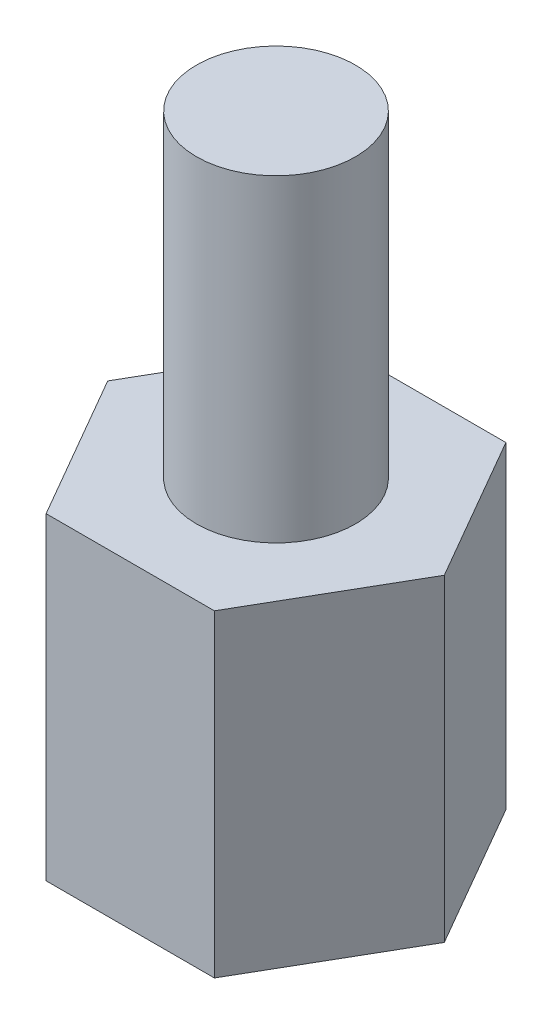
ISO-10303-21;
HEADER;
FILE_DESCRIPTION(('STEP AP214'),'2;1');
FILE_NAME('part.step','',(''),(''),'','','');
FILE_SCHEMA(('AUTOMOTIVE_DESIGN { 1 0 10303 214 1 1 1 1 }'));
ENDSEC;
DATA;
#1=APPLICATION_CONTEXT('core data for automotive mechanical design processes');
#2=APPLICATION_PROTOCOL_DEFINITION('international standard','automotive_design',2000,#1);
#3=PRODUCT_CONTEXT('',#1,'mechanical');
#4=PRODUCT('Part','Part','',(#3));
#5=PRODUCT_RELATED_PRODUCT_CATEGORY('part','',(#4));
#6=PRODUCT_DEFINITION_FORMATION('','',#4);
#7=PRODUCT_DEFINITION_CONTEXT('part definition',#1,'design');
#8=PRODUCT_DEFINITION('design','',#6,#7);
#9=PRODUCT_DEFINITION_SHAPE('','',#8);
#10=(LENGTH_UNIT() NAMED_UNIT(*) SI_UNIT(.MILLI.,.METRE.));
#11=(NAMED_UNIT(*) PLANE_ANGLE_UNIT() SI_UNIT($,.RADIAN.));
#12=(NAMED_UNIT(*) SI_UNIT($,.STERADIAN.) SOLID_ANGLE_UNIT());
#13=UNCERTAINTY_MEASURE_WITH_UNIT(LENGTH_MEASURE(1.E-05),#10,'distance_accuracy_value','');
#14=(GEOMETRIC_REPRESENTATION_CONTEXT(3) GLOBAL_UNCERTAINTY_ASSIGNED_CONTEXT((#13)) GLOBAL_UNIT_ASSIGNED_CONTEXT((#10,
#11,#12)) REPRESENTATION_CONTEXT('',''));
#15=CARTESIAN_POINT('',(0.,0.,0.));
#16=DIRECTION('',(0.,0.,1.));
#17=DIRECTION('',(1.,0.,0.));
#18=AXIS2_PLACEMENT_3D('',#15,#16,#17);
#19=CARTESIAN_POINT('',(1.58771324027147,6.,2.75000000000001));
#20=DIRECTION('',(-0.866025403784439,0.,-0.5));
#21=DIRECTION('',(-0.5,0.,0.866025403784439));
#22=AXIS2_PLACEMENT_3D('',#19,#20,#21);
#23=PLANE('',#22);
#24=DIRECTION('',(0.5,0.,-0.866025403784439));
#25=VECTOR('',#24,1.);
#26=CARTESIAN_POINT('',(1.58771324027147,0.,2.75000000000001));
#27=LINE('',#26,#25);
#28=CARTESIAN_POINT('',(1.58771324027147,0.,2.75000000000001));
#29=VERTEX_POINT('',#28);
#30=CARTESIAN_POINT('',(3.17542648054294,0.,0.));
#31=VERTEX_POINT('',#30);
#32=EDGE_CURVE('E136',#29,#31,#27,.T.);
#33=ORIENTED_EDGE('',*,*,#32,.T.);
#34=DIRECTION('',(0.,-1.,0.));
#35=VECTOR('',#34,1.);
#36=CARTESIAN_POINT('',(3.17542648054294,6.,0.));
#37=LINE('',#36,#35);
#38=CARTESIAN_POINT('',(3.17542648054294,6.,0.));
#39=VERTEX_POINT('',#38);
#40=EDGE_CURVE('E48',#39,#31,#37,.T.);
#41=ORIENTED_EDGE('',*,*,#40,.F.);
#42=DIRECTION('',(0.5,0.,-0.866025403784439));
#43=VECTOR('',#42,1.);
#44=CARTESIAN_POINT('',(1.58771324027147,6.,2.75000000000001));
#45=LINE('',#44,#43);
#46=CARTESIAN_POINT('',(1.58771324027147,6.,2.75000000000001));
#47=VERTEX_POINT('',#46);
#48=EDGE_CURVE('E153',#47,#39,#45,.T.);
#49=ORIENTED_EDGE('',*,*,#48,.F.);
#50=DIRECTION('',(0.,-1.,0.));
#51=VECTOR('',#50,1.);
#52=CARTESIAN_POINT('',(1.58771324027147,6.,2.75000000000001));
#53=LINE('',#52,#51);
#54=EDGE_CURVE('E132',#47,#29,#53,.T.);
#55=ORIENTED_EDGE('',*,*,#54,.T.);
#56=EDGE_LOOP('',(#33,#41,#49,#55));
#57=FACE_BOUND('',#56,.T.);
#58=ADVANCED_FACE('F45',(#57),#23,.F.);
#59=CARTESIAN_POINT('',(3.17542648054294,6.,0.));
#60=DIRECTION('',(-0.866025403784439,0.,0.5));
#61=DIRECTION('',(0.5,0.,0.866025403784439));
#62=AXIS2_PLACEMENT_3D('',#59,#60,#61);
#63=PLANE('',#62);
#64=DIRECTION('',(-0.5,0.,-0.866025403784439));
#65=VECTOR('',#64,1.);
#66=CARTESIAN_POINT('',(3.17542648054294,0.,0.));
#67=LINE('',#66,#65);
#68=CARTESIAN_POINT('',(1.58771324027147,0.,-2.75000000000001));
#69=VERTEX_POINT('',#68);
#70=EDGE_CURVE('E140',#31,#69,#67,.T.);
#71=ORIENTED_EDGE('',*,*,#70,.T.);
#72=DIRECTION('',(0.,-1.,0.));
#73=VECTOR('',#72,1.);
#74=CARTESIAN_POINT('',(1.58771324027147,6.,-2.75000000000001));
#75=LINE('',#74,#73);
#76=CARTESIAN_POINT('',(1.58771324027147,6.,-2.75000000000001));
#77=VERTEX_POINT('',#76);
#78=EDGE_CURVE('E159',#77,#69,#75,.T.);
#79=ORIENTED_EDGE('',*,*,#78,.F.);
#80=DIRECTION('',(-0.5,0.,-0.866025403784439));
#81=VECTOR('',#80,1.);
#82=CARTESIAN_POINT('',(3.17542648054294,6.,0.));
#83=LINE('',#82,#81);
#84=EDGE_CURVE('E101',#39,#77,#83,.T.);
#85=ORIENTED_EDGE('',*,*,#84,.F.);
#86=ORIENTED_EDGE('',*,*,#40,.T.);
#87=EDGE_LOOP('',(#71,#79,#85,#86));
#88=FACE_BOUND('',#87,.T.);
#89=ADVANCED_FACE('F166',(#88),#63,.F.);
#90=CARTESIAN_POINT('',(1.58771324027147,6.,-2.75000000000001));
#91=DIRECTION('',(0.,0.,1.));
#92=DIRECTION('',(1.,0.,0.));
#93=AXIS2_PLACEMENT_3D('',#90,#91,#92);
#94=PLANE('',#93);
#95=DIRECTION('',(-1.,0.,0.));
#96=VECTOR('',#95,1.);
#97=CARTESIAN_POINT('',(1.58771324027147,0.,-2.75000000000001));
#98=LINE('',#97,#96);
#99=CARTESIAN_POINT('',(-1.58771324027147,0.,-2.75000000000001));
#100=VERTEX_POINT('',#99);
#101=EDGE_CURVE('E144',#69,#100,#98,.T.);
#102=ORIENTED_EDGE('',*,*,#101,.T.);
#103=DIRECTION('',(0.,-1.,0.));
#104=VECTOR('',#103,1.);
#105=CARTESIAN_POINT('',(-1.58771324027147,6.,-2.75000000000001));
#106=LINE('',#105,#104);
#107=CARTESIAN_POINT('',(-1.58771324027147,6.,-2.75000000000001));
#108=VERTEX_POINT('',#107);
#109=EDGE_CURVE('E125',#108,#100,#106,.T.);
#110=ORIENTED_EDGE('',*,*,#109,.F.);
#111=DIRECTION('',(-1.,0.,0.));
#112=VECTOR('',#111,1.);
#113=CARTESIAN_POINT('',(1.58771324027147,6.,-2.75000000000001));
#114=LINE('',#113,#112);
#115=EDGE_CURVE('E114',#77,#108,#114,.T.);
#116=ORIENTED_EDGE('',*,*,#115,.F.);
#117=ORIENTED_EDGE('',*,*,#78,.T.);
#118=EDGE_LOOP('',(#102,#110,#116,#117));
#119=FACE_BOUND('',#118,.T.);
#120=ADVANCED_FACE('F172',(#119),#94,.F.);
#121=CARTESIAN_POINT('',(-1.58771324027147,6.,-2.75000000000001));
#122=DIRECTION('',(0.866025403784439,0.,0.499999999999999));
#123=DIRECTION('',(0.499999999999999,0.,-0.866025403784439));
#124=AXIS2_PLACEMENT_3D('',#121,#122,#123);
#125=PLANE('',#124);
#126=DIRECTION('',(-0.499999999999999,0.,0.866025403784439));
#127=VECTOR('',#126,1.);
#128=CARTESIAN_POINT('',(-1.58771324027147,0.,-2.75000000000001));
#129=LINE('',#128,#127);
#130=CARTESIAN_POINT('',(-3.17542648054295,0.,0.));
#131=VERTEX_POINT('',#130);
#132=EDGE_CURVE('E123',#100,#131,#129,.T.);
#133=ORIENTED_EDGE('',*,*,#132,.T.);
#134=DIRECTION('',(0.,-1.,0.));
#135=VECTOR('',#134,1.);
#136=CARTESIAN_POINT('',(-3.17542648054295,6.,0.));
#137=LINE('',#136,#135);
#138=CARTESIAN_POINT('',(-3.17542648054295,6.,0.));
#139=VERTEX_POINT('',#138);
#140=EDGE_CURVE('E120',#139,#131,#137,.T.);
#141=ORIENTED_EDGE('',*,*,#140,.F.);
#142=DIRECTION('',(-0.499999999999999,0.,0.866025403784439));
#143=VECTOR('',#142,1.);
#144=CARTESIAN_POINT('',(-1.58771324027147,6.,-2.75000000000001));
#145=LINE('',#144,#143);
#146=EDGE_CURVE('E108',#108,#139,#145,.T.);
#147=ORIENTED_EDGE('',*,*,#146,.F.);
#148=ORIENTED_EDGE('',*,*,#109,.T.);
#149=EDGE_LOOP('',(#133,#141,#147,#148));
#150=FACE_BOUND('',#149,.T.);
#151=ADVANCED_FACE('F121',(#150),#125,.F.);
#152=CARTESIAN_POINT('',(-3.17542648054295,6.,0.));
#153=DIRECTION('',(0.866025403784439,0.,-0.499999999999999));
#154=DIRECTION('',(-0.5,0.,-0.866025403784439));
#155=AXIS2_PLACEMENT_3D('',#152,#153,#154);
#156=PLANE('',#155);
#157=DIRECTION('',(0.5,0.,0.866025403784439));
#158=VECTOR('',#157,1.);
#159=CARTESIAN_POINT('',(-3.17542648054295,0.,0.));
#160=LINE('',#159,#158);
#161=CARTESIAN_POINT('',(-1.58771324027148,0.,2.75000000000001));
#162=VERTEX_POINT('',#161);
#163=EDGE_CURVE('E86',#131,#162,#160,.T.);
#164=ORIENTED_EDGE('',*,*,#163,.T.);
#165=DIRECTION('',(0.,-1.,0.));
#166=VECTOR('',#165,1.);
#167=CARTESIAN_POINT('',(-1.58771324027148,6.,2.75000000000001));
#168=LINE('',#167,#166);
#169=CARTESIAN_POINT('',(-1.58771324027148,6.,2.75000000000001));
#170=VERTEX_POINT('',#169);
#171=EDGE_CURVE('E126',#170,#162,#168,.T.);
#172=ORIENTED_EDGE('',*,*,#171,.F.);
#173=DIRECTION('',(0.5,0.,0.866025403784439));
#174=VECTOR('',#173,1.);
#175=CARTESIAN_POINT('',(-3.17542648054295,6.,0.));
#176=LINE('',#175,#174);
#177=EDGE_CURVE('E112',#139,#170,#176,.T.);
#178=ORIENTED_EDGE('',*,*,#177,.F.);
#179=ORIENTED_EDGE('',*,*,#140,.T.);
#180=EDGE_LOOP('',(#164,#172,#178,#179));
#181=FACE_BOUND('',#180,.T.);
#182=ADVANCED_FACE('F128',(#181),#156,.F.);
#183=CARTESIAN_POINT('',(-1.58771324027148,6.,2.75000000000001));
#184=DIRECTION('',(0.,0.,-1.));
#185=DIRECTION('',(-1.,0.,0.));
#186=AXIS2_PLACEMENT_3D('',#183,#184,#185);
#187=PLANE('',#186);
#188=DIRECTION('',(1.,0.,0.));
#189=VECTOR('',#188,1.);
#190=CARTESIAN_POINT('',(-1.58771324027148,0.,2.75000000000001));
#191=LINE('',#190,#189);
#192=EDGE_CURVE('E92',#162,#29,#191,.T.);
#193=ORIENTED_EDGE('',*,*,#192,.T.);
#194=ORIENTED_EDGE('',*,*,#54,.F.);
#195=DIRECTION('',(1.,0.,0.));
#196=VECTOR('',#195,1.);
#197=CARTESIAN_POINT('',(-1.58771324027148,6.,2.75000000000001));
#198=LINE('',#197,#196);
#199=EDGE_CURVE('E63',#170,#47,#198,.T.);
#200=ORIENTED_EDGE('',*,*,#199,.F.);
#201=ORIENTED_EDGE('',*,*,#171,.T.);
#202=EDGE_LOOP('',(#193,#194,#200,#201));
#203=FACE_BOUND('',#202,.T.);
#204=ADVANCED_FACE('F201',(#203),#187,.F.);
#205=CARTESIAN_POINT('',(0.,6.,0.));
#206=DIRECTION('',(0.,1.,0.));
#207=DIRECTION('',(0.,0.,1.));
#208=AXIS2_PLACEMENT_3D('',#205,#206,#207);
#209=PLANE('',#208);
#210=CARTESIAN_POINT('',(0.,6.,0.));
#211=DIRECTION('',(0.,1.,0.));
#212=DIRECTION('',(0.,0.,1.));
#213=AXIS2_PLACEMENT_3D('',#210,#211,#212);
#214=CIRCLE('',#213,1.5);
#215=CARTESIAN_POINT('',(0.,6.,1.5));
#216=VERTEX_POINT('',#215);
#217=EDGE_CURVE('E11',#216,#216,#214,.T.);
#218=ORIENTED_EDGE('',*,*,#217,.F.);
#219=EDGE_LOOP('',(#218));
#220=FACE_BOUND('',#219,.T.);
#221=ORIENTED_EDGE('',*,*,#48,.T.);
#222=ORIENTED_EDGE('',*,*,#84,.T.);
#223=ORIENTED_EDGE('',*,*,#115,.T.);
#224=ORIENTED_EDGE('',*,*,#146,.T.);
#225=ORIENTED_EDGE('',*,*,#177,.T.);
#226=ORIENTED_EDGE('',*,*,#199,.T.);
#227=EDGE_LOOP('',(#221,#222,#223,#224,#225,#226));
#228=FACE_BOUND('',#227,.T.);
#229=ADVANCED_FACE('F110',(#220,#228),#209,.T.);
#230=CARTESIAN_POINT('',(0.,0.,0.));
#231=DIRECTION('',(0.,1.,0.));
#232=DIRECTION('',(0.,0.,1.));
#233=AXIS2_PLACEMENT_3D('',#230,#231,#232);
#234=PLANE('',#233);
#235=CARTESIAN_POINT('',(0.,0.,0.));
#236=DIRECTION('',(0.,-1.,0.));
#237=DIRECTION('',(0.,0.,-1.));
#238=AXIS2_PLACEMENT_3D('',#235,#236,#237);
#239=CIRCLE('',#238,1.5);
#240=CARTESIAN_POINT('',(0.,0.,-1.5));
#241=VERTEX_POINT('',#240);
#242=EDGE_CURVE('E179',#241,#241,#239,.T.);
#243=ORIENTED_EDGE('',*,*,#242,.F.);
#244=EDGE_LOOP('',(#243));
#245=FACE_BOUND('',#244,.T.);
#246=ORIENTED_EDGE('',*,*,#32,.F.);
#247=ORIENTED_EDGE('',*,*,#192,.F.);
#248=ORIENTED_EDGE('',*,*,#163,.F.);
#249=ORIENTED_EDGE('',*,*,#132,.F.);
#250=ORIENTED_EDGE('',*,*,#101,.F.);
#251=ORIENTED_EDGE('',*,*,#70,.F.);
#252=EDGE_LOOP('',(#246,#247,#248,#249,#250,#251));
#253=FACE_BOUND('',#252,.T.);
#254=ADVANCED_FACE('F171',(#245,#253),#234,.F.);
#255=CARTESIAN_POINT('',(0.,4.,0.));
#256=DIRECTION('',(0.,-1.,0.));
#257=DIRECTION('',(0.,0.,-1.));
#258=AXIS2_PLACEMENT_3D('',#255,#256,#257);
#259=CYLINDRICAL_SURFACE('',#258,1.5);
#260=CARTESIAN_POINT('',(0.,4.,0.));
#261=DIRECTION('',(0.,-1.,0.));
#262=DIRECTION('',(0.,0.,-1.));
#263=AXIS2_PLACEMENT_3D('',#260,#261,#262);
#264=CIRCLE('',#263,1.5);
#265=CARTESIAN_POINT('',(0.,4.,-1.5));
#266=VERTEX_POINT('',#265);
#267=EDGE_CURVE('E141',#266,#266,#264,.T.);
#268=ORIENTED_EDGE('',*,*,#267,.F.);
#269=EDGE_LOOP('',(#268));
#270=FACE_BOUND('',#269,.T.);
#271=ORIENTED_EDGE('',*,*,#242,.T.);
#272=EDGE_LOOP('',(#271));
#273=FACE_BOUND('',#272,.T.);
#274=ADVANCED_FACE('F207',(#270,#273),#259,.F.);
#275=CARTESIAN_POINT('',(0.,4.,0.));
#276=DIRECTION('',(0.,-1.,0.));
#277=DIRECTION('',(0.,0.,-1.));
#278=AXIS2_PLACEMENT_3D('',#275,#276,#277);
#279=PLANE('',#278);
#280=ORIENTED_EDGE('',*,*,#267,.T.);
#281=EDGE_LOOP('',(#280));
#282=FACE_BOUND('',#281,.T.);
#283=ADVANCED_FACE('F196',(#282),#279,.T.);
#284=CARTESIAN_POINT('',(0.,12.,0.));
#285=DIRECTION('',(0.,-1.,0.));
#286=DIRECTION('',(0.,0.,-1.));
#287=AXIS2_PLACEMENT_3D('',#284,#285,#286);
#288=CYLINDRICAL_SURFACE('',#287,1.5);
#289=CARTESIAN_POINT('',(0.,12.,0.));
#290=DIRECTION('',(0.,1.,0.));
#291=DIRECTION('',(0.,0.,1.));
#292=AXIS2_PLACEMENT_3D('',#289,#290,#291);
#293=CIRCLE('',#292,1.5);
#294=CARTESIAN_POINT('',(0.,12.,1.5));
#295=VERTEX_POINT('',#294);
#296=EDGE_CURVE('E183',#295,#295,#293,.T.);
#297=ORIENTED_EDGE('',*,*,#296,.F.);
#298=EDGE_LOOP('',(#297));
#299=FACE_BOUND('',#298,.T.);
#300=ORIENTED_EDGE('',*,*,#217,.T.);
#301=EDGE_LOOP('',(#300));
#302=FACE_BOUND('',#301,.T.);
#303=ADVANCED_FACE('F193',(#299,#302),#288,.T.);
#304=CARTESIAN_POINT('',(0.,12.,0.));
#305=DIRECTION('',(0.,1.,0.));
#306=DIRECTION('',(0.,0.,1.));
#307=AXIS2_PLACEMENT_3D('',#304,#305,#306);
#308=PLANE('',#307);
#309=ORIENTED_EDGE('',*,*,#296,.T.);
#310=EDGE_LOOP('',(#309));
#311=FACE_BOUND('',#310,.T.);
#312=ADVANCED_FACE('F191',(#311),#308,.T.);
#313=CLOSED_SHELL('',(#58,#89,#120,#151,#182,#204,#229,#254,#274,#283,#303,#312));
#314=MANIFOLD_SOLID_BREP('B2',#313);
#315=ADVANCED_BREP_SHAPE_REPRESENTATION('',(#18,#314),#14);
#316=SHAPE_DEFINITION_REPRESENTATION(#9,#315);
ENDSEC;
END-ISO-10303-21;
